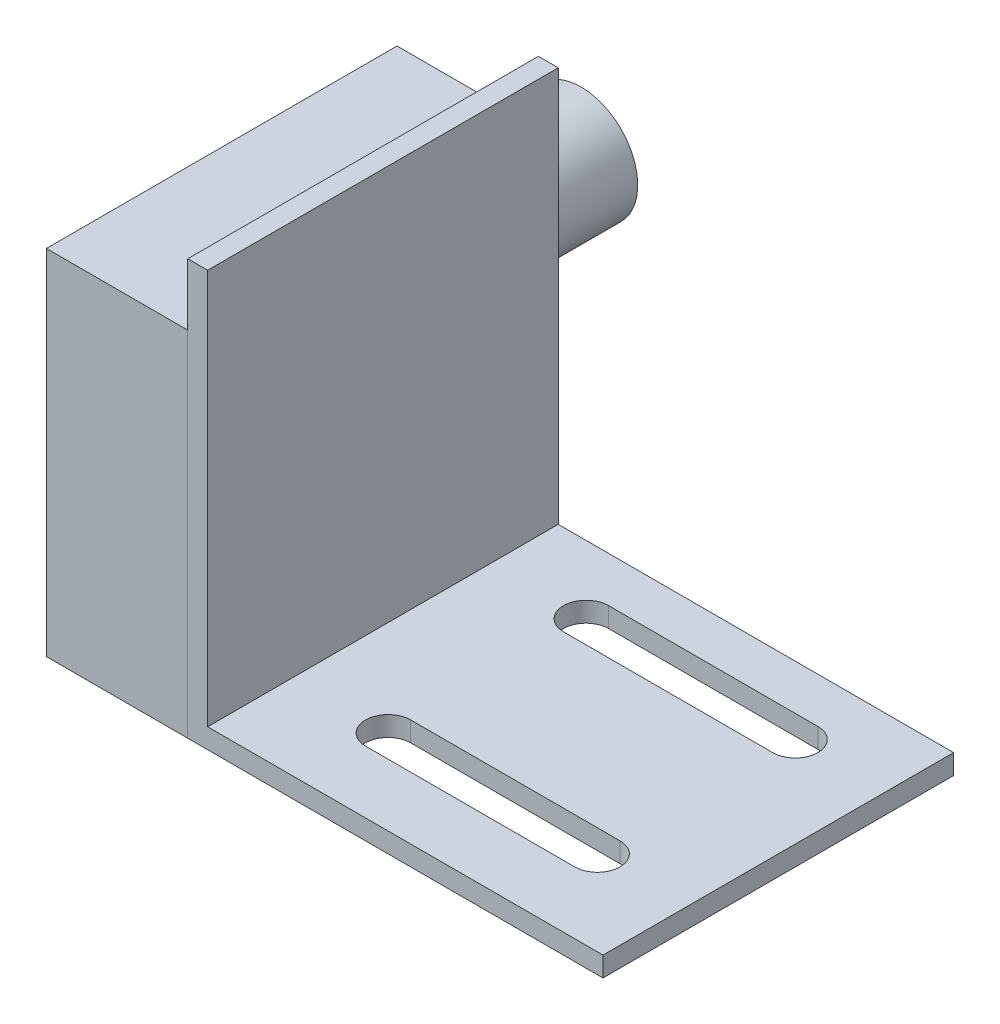
ISO-10303-21;
HEADER;
FILE_DESCRIPTION(('STEP AP214'),'2;1');
FILE_NAME('part.step','',(''),(''),'','','');
FILE_SCHEMA(('AUTOMOTIVE_DESIGN { 1 0 10303 214 1 1 1 1 }'));
ENDSEC;
DATA;
#1=APPLICATION_CONTEXT('core data for automotive mechanical design processes');
#2=APPLICATION_PROTOCOL_DEFINITION('international standard','automotive_design',2000,#1);
#3=PRODUCT_CONTEXT('',#1,'mechanical');
#4=PRODUCT('Part','Part','',(#3));
#5=PRODUCT_RELATED_PRODUCT_CATEGORY('part','',(#4));
#6=PRODUCT_DEFINITION_FORMATION('','',#4);
#7=PRODUCT_DEFINITION_CONTEXT('part definition',#1,'design');
#8=PRODUCT_DEFINITION('design','',#6,#7);
#9=PRODUCT_DEFINITION_SHAPE('','',#8);
#10=(LENGTH_UNIT() NAMED_UNIT(*) SI_UNIT(.MILLI.,.METRE.));
#11=(NAMED_UNIT(*) PLANE_ANGLE_UNIT() SI_UNIT($,.RADIAN.));
#12=(NAMED_UNIT(*) SI_UNIT($,.STERADIAN.) SOLID_ANGLE_UNIT());
#13=UNCERTAINTY_MEASURE_WITH_UNIT(LENGTH_MEASURE(1.E-05),#10,'distance_accuracy_value','');
#14=(GEOMETRIC_REPRESENTATION_CONTEXT(3) GLOBAL_UNCERTAINTY_ASSIGNED_CONTEXT((#13)) GLOBAL_UNIT_ASSIGNED_CONTEXT((#10,
#11,#12)) REPRESENTATION_CONTEXT('',''));
#15=CARTESIAN_POINT('',(0.,0.,0.));
#16=DIRECTION('',(0.,0.,1.));
#17=DIRECTION('',(1.,0.,0.));
#18=AXIS2_PLACEMENT_3D('',#15,#16,#17);
#19=CARTESIAN_POINT('',(-12.7,0.,15.748));
#20=DIRECTION('',(0.,0.,-1.));
#21=DIRECTION('',(-1.,0.,0.));
#22=AXIS2_PLACEMENT_3D('',#19,#20,#21);
#23=PLANE('',#22);
#24=DIRECTION('',(0.,1.,0.));
#25=VECTOR('',#24,1.);
#26=CARTESIAN_POINT('',(0.,0.,15.748));
#27=LINE('',#26,#25);
#28=CARTESIAN_POINT('',(0.,0.,15.748));
#29=VERTEX_POINT('',#28);
#30=CARTESIAN_POINT('',(0.,31.75,15.748));
#31=VERTEX_POINT('',#30);
#32=EDGE_CURVE('E109',#29,#31,#27,.T.);
#33=ORIENTED_EDGE('',*,*,#32,.T.);
#34=DIRECTION('',(1.,0.,0.));
#35=VECTOR('',#34,1.);
#36=CARTESIAN_POINT('',(-12.7,31.75,15.748));
#37=LINE('',#36,#35);
#38=CARTESIAN_POINT('',(-12.7,31.75,15.748));
#39=VERTEX_POINT('',#38);
#40=EDGE_CURVE('E46',#39,#31,#37,.T.);
#41=ORIENTED_EDGE('',*,*,#40,.F.);
#42=DIRECTION('',(0.,1.,0.));
#43=VECTOR('',#42,1.);
#44=CARTESIAN_POINT('',(-12.7,0.,15.748));
#45=LINE('',#44,#43);
#46=CARTESIAN_POINT('',(-12.7,0.,15.748));
#47=VERTEX_POINT('',#46);
#48=EDGE_CURVE('E96',#47,#39,#45,.T.);
#49=ORIENTED_EDGE('',*,*,#48,.F.);
#50=DIRECTION('',(1.,0.,0.));
#51=VECTOR('',#50,1.);
#52=CARTESIAN_POINT('',(-12.7,0.,15.748));
#53=LINE('',#52,#51);
#54=EDGE_CURVE('E105',#47,#29,#53,.T.);
#55=ORIENTED_EDGE('',*,*,#54,.T.);
#56=EDGE_LOOP('',(#33,#41,#49,#55));
#57=FACE_BOUND('',#56,.T.);
#58=ADVANCED_FACE('F43',(#57),#23,.F.);
#59=CARTESIAN_POINT('',(-12.7,31.75,15.748));
#60=DIRECTION('',(0.,-1.,0.));
#61=DIRECTION('',(0.,0.,-1.));
#62=AXIS2_PLACEMENT_3D('',#59,#60,#61);
#63=PLANE('',#62);
#64=DIRECTION('',(0.,0.,-1.));
#65=VECTOR('',#64,1.);
#66=CARTESIAN_POINT('',(0.,31.75,15.748));
#67=LINE('',#66,#65);
#68=CARTESIAN_POINT('',(0.,31.75,-15.748));
#69=VERTEX_POINT('',#68);
#70=EDGE_CURVE('E101',#31,#69,#67,.T.);
#71=ORIENTED_EDGE('',*,*,#70,.T.);
#72=DIRECTION('',(1.,0.,0.));
#73=VECTOR('',#72,1.);
#74=CARTESIAN_POINT('',(-12.7,31.75,-15.748));
#75=LINE('',#74,#73);
#76=CARTESIAN_POINT('',(-12.7,31.75,-15.748));
#77=VERTEX_POINT('',#76);
#78=EDGE_CURVE('E99',#77,#69,#75,.T.);
#79=ORIENTED_EDGE('',*,*,#78,.F.);
#80=DIRECTION('',(0.,0.,-1.));
#81=VECTOR('',#80,1.);
#82=CARTESIAN_POINT('',(-12.7,31.75,15.748));
#83=LINE('',#82,#81);
#84=EDGE_CURVE('E91',#39,#77,#83,.T.);
#85=ORIENTED_EDGE('',*,*,#84,.F.);
#86=ORIENTED_EDGE('',*,*,#40,.T.);
#87=EDGE_LOOP('',(#71,#79,#85,#86));
#88=FACE_BOUND('',#87,.T.);
#89=ADVANCED_FACE('F100',(#88),#63,.F.);
#90=CARTESIAN_POINT('',(-12.7,0.,-15.748));
#91=DIRECTION('',(0.,0.,1.));
#92=DIRECTION('',(1.,0.,0.));
#93=AXIS2_PLACEMENT_3D('',#90,#91,#92);
#94=PLANE('',#93);
#95=CARTESIAN_POINT('',(-6.32090999527844,21.59,-15.748));
#96=DIRECTION('',(0.,0.,-1.));
#97=DIRECTION('',(-1.,0.,0.));
#98=AXIS2_PLACEMENT_3D('',#95,#96,#97);
#99=CIRCLE('',#98,5.08);
#100=CARTESIAN_POINT('',(-11.4009099952784,21.59,-15.748));
#101=VERTEX_POINT('',#100);
#102=EDGE_CURVE('E12',#101,#101,#99,.T.);
#103=ORIENTED_EDGE('',*,*,#102,.F.);
#104=EDGE_LOOP('',(#103));
#105=FACE_BOUND('',#104,.T.);
#106=DIRECTION('',(0.,-1.,0.));
#107=VECTOR('',#106,1.);
#108=CARTESIAN_POINT('',(0.,0.,-15.748));
#109=LINE('',#108,#107);
#110=CARTESIAN_POINT('',(0.,0.,-15.748));
#111=VERTEX_POINT('',#110);
#112=EDGE_CURVE('E77',#69,#111,#109,.T.);
#113=ORIENTED_EDGE('',*,*,#112,.T.);
#114=DIRECTION('',(1.,0.,0.));
#115=VECTOR('',#114,1.);
#116=CARTESIAN_POINT('',(-12.7,0.,-15.748));
#117=LINE('',#116,#115);
#118=CARTESIAN_POINT('',(-12.7,0.,-15.748));
#119=VERTEX_POINT('',#118);
#120=EDGE_CURVE('E102',#119,#111,#117,.T.);
#121=ORIENTED_EDGE('',*,*,#120,.F.);
#122=DIRECTION('',(0.,-1.,0.));
#123=VECTOR('',#122,1.);
#124=CARTESIAN_POINT('',(-12.7,0.,-15.748));
#125=LINE('',#124,#123);
#126=EDGE_CURVE('E94',#77,#119,#125,.T.);
#127=ORIENTED_EDGE('',*,*,#126,.F.);
#128=ORIENTED_EDGE('',*,*,#78,.T.);
#129=EDGE_LOOP('',(#113,#121,#127,#128));
#130=FACE_BOUND('',#129,.T.);
#131=ADVANCED_FACE('F103',(#105,#130),#94,.F.);
#132=CARTESIAN_POINT('',(-12.7,0.,15.748));
#133=DIRECTION('',(0.,1.,0.));
#134=DIRECTION('',(0.,0.,1.));
#135=AXIS2_PLACEMENT_3D('',#132,#133,#134);
#136=PLANE('',#135);
#137=DIRECTION('',(0.,0.,1.));
#138=VECTOR('',#137,1.);
#139=CARTESIAN_POINT('',(0.,0.,15.748));
#140=LINE('',#139,#138);
#141=EDGE_CURVE('E83',#111,#29,#140,.T.);
#142=ORIENTED_EDGE('',*,*,#141,.T.);
#143=ORIENTED_EDGE('',*,*,#54,.F.);
#144=DIRECTION('',(0.,0.,1.));
#145=VECTOR('',#144,1.);
#146=CARTESIAN_POINT('',(-12.7,0.,15.748));
#147=LINE('',#146,#145);
#148=EDGE_CURVE('E60',#119,#47,#147,.T.);
#149=ORIENTED_EDGE('',*,*,#148,.F.);
#150=ORIENTED_EDGE('',*,*,#120,.T.);
#151=EDGE_LOOP('',(#142,#143,#149,#150));
#152=FACE_BOUND('',#151,.T.);
#153=ADVANCED_FACE('F117',(#152),#136,.F.);
#154=CARTESIAN_POINT('',(-12.7,0.,0.));
#155=DIRECTION('',(-1.,0.,0.));
#156=DIRECTION('',(0.,0.,1.));
#157=AXIS2_PLACEMENT_3D('',#154,#155,#156);
#158=PLANE('',#157);
#159=ORIENTED_EDGE('',*,*,#48,.T.);
#160=ORIENTED_EDGE('',*,*,#84,.T.);
#161=ORIENTED_EDGE('',*,*,#126,.T.);
#162=ORIENTED_EDGE('',*,*,#148,.T.);
#163=EDGE_LOOP('',(#159,#160,#161,#162));
#164=FACE_BOUND('',#163,.T.);
#165=ADVANCED_FACE('F92',(#164),#158,.T.);
#166=CARTESIAN_POINT('',(0.,0.,0.));
#167=DIRECTION('',(-1.,0.,0.));
#168=DIRECTION('',(0.,0.,1.));
#169=AXIS2_PLACEMENT_3D('',#166,#167,#168);
#170=PLANE('',#169);
#171=ORIENTED_EDGE('',*,*,#32,.F.);
#172=ORIENTED_EDGE('',*,*,#141,.F.);
#173=ORIENTED_EDGE('',*,*,#112,.F.);
#174=ORIENTED_EDGE('',*,*,#70,.F.);
#175=EDGE_LOOP('',(#171,#172,#173,#174));
#176=FACE_BOUND('',#175,.T.);
#177=ADVANCED_FACE('F120',(#176),#170,.F.);
#178=CARTESIAN_POINT('',(-6.32090999527844,21.59,-25.908));
#179=DIRECTION('',(0.,0.,1.));
#180=DIRECTION('',(1.,0.,0.));
#181=AXIS2_PLACEMENT_3D('',#178,#179,#180);
#182=CYLINDRICAL_SURFACE('',#181,5.08);
#183=CARTESIAN_POINT('',(-6.32090999527844,21.59,-25.908));
#184=DIRECTION('',(0.,0.,-1.));
#185=DIRECTION('',(-1.,0.,0.));
#186=AXIS2_PLACEMENT_3D('',#183,#184,#185);
#187=CIRCLE('',#186,5.08);
#188=CARTESIAN_POINT('',(-11.4009099952784,21.59,-25.908));
#189=VERTEX_POINT('',#188);
#190=EDGE_CURVE('E112',#189,#189,#187,.T.);
#191=ORIENTED_EDGE('',*,*,#190,.F.);
#192=EDGE_LOOP('',(#191));
#193=FACE_BOUND('',#192,.T.);
#194=ORIENTED_EDGE('',*,*,#102,.T.);
#195=EDGE_LOOP('',(#194));
#196=FACE_BOUND('',#195,.T.);
#197=ADVANCED_FACE('F128',(#193,#196),#182,.T.);
#198=CARTESIAN_POINT('',(-6.32090999527844,21.59,-25.908));
#199=DIRECTION('',(0.,0.,-1.));
#200=DIRECTION('',(-1.,0.,0.));
#201=AXIS2_PLACEMENT_3D('',#198,#199,#200);
#202=PLANE('',#201);
#203=ORIENTED_EDGE('',*,*,#190,.T.);
#204=EDGE_LOOP('',(#203));
#205=FACE_BOUND('',#204,.T.);
#206=ADVANCED_FACE('F126',(#205),#202,.T.);
#207=CLOSED_SHELL('',(#58,#89,#131,#153,#165,#177,#197,#206));
#208=MANIFOLD_SOLID_BREP('B2',#207);
#209=CARTESIAN_POINT('',(37.2983127050204,0.,15.748));
#210=DIRECTION('',(0.,1.,0.));
#211=DIRECTION('',(-1.,0.,0.));
#212=AXIS2_PLACEMENT_3D('',#209,#210,#211);
#213=PLANE('',#212);
#214=DIRECTION('',(1.,0.,0.));
#215=VECTOR('',#214,1.);
#216=CARTESIAN_POINT('',(29.1703127050204,0.,10.16));
#217=LINE('',#216,#215);
#218=CARTESIAN_POINT('',(10.3743127050204,0.,10.16));
#219=VERTEX_POINT('',#218);
#220=CARTESIAN_POINT('',(29.1703127050204,0.,10.16));
#221=VERTEX_POINT('',#220);
#222=EDGE_CURVE('E305',#219,#221,#217,.T.);
#223=ORIENTED_EDGE('',*,*,#222,.T.);
#224=CARTESIAN_POINT('',(29.1703127050204,0.,8.128));
#225=DIRECTION('',(0.,1.,0.));
#226=DIRECTION('',(0.,0.,1.));
#227=AXIS2_PLACEMENT_3D('',#224,#225,#226);
#228=CIRCLE('',#227,2.032);
#229=CARTESIAN_POINT('',(29.1703127050204,0.,6.096));
#230=VERTEX_POINT('',#229);
#231=EDGE_CURVE('E299',#221,#230,#228,.T.);
#232=ORIENTED_EDGE('',*,*,#231,.T.);
#233=DIRECTION('',(-1.,0.,0.));
#234=VECTOR('',#233,1.);
#235=CARTESIAN_POINT('',(29.1703127050204,0.,6.096));
#236=LINE('',#235,#234);
#237=CARTESIAN_POINT('',(10.3743127050204,0.,6.096));
#238=VERTEX_POINT('',#237);
#239=EDGE_CURVE('E308',#230,#238,#236,.T.);
#240=ORIENTED_EDGE('',*,*,#239,.T.);
#241=CARTESIAN_POINT('',(10.3743127050204,0.,8.128));
#242=DIRECTION('',(0.,1.,0.));
#243=DIRECTION('',(0.,0.,1.));
#244=AXIS2_PLACEMENT_3D('',#241,#242,#243);
#245=CIRCLE('',#244,2.032);
#246=EDGE_CURVE('E211',#238,#219,#245,.T.);
#247=ORIENTED_EDGE('',*,*,#246,.T.);
#248=EDGE_LOOP('',(#223,#232,#240,#247));
#249=FACE_BOUND('',#248,.T.);
#250=DIRECTION('',(1.,0.,0.));
#251=VECTOR('',#250,1.);
#252=CARTESIAN_POINT('',(29.1703127050204,0.,-7.62));
#253=LINE('',#252,#251);
#254=CARTESIAN_POINT('',(10.3743127050204,0.,-7.61999999999999));
#255=VERTEX_POINT('',#254);
#256=CARTESIAN_POINT('',(29.1703127050204,0.,-7.62));
#257=VERTEX_POINT('',#256);
#258=EDGE_CURVE('E343',#255,#257,#253,.T.);
#259=ORIENTED_EDGE('',*,*,#258,.T.);
#260=CARTESIAN_POINT('',(29.1703127050204,0.,-9.652));
#261=DIRECTION('',(0.,1.,0.));
#262=DIRECTION('',(0.,0.,1.));
#263=AXIS2_PLACEMENT_3D('',#260,#261,#262);
#264=CIRCLE('',#263,2.032);
#265=CARTESIAN_POINT('',(29.1703127050204,0.,-11.684));
#266=VERTEX_POINT('',#265);
#267=EDGE_CURVE('E333',#257,#266,#264,.T.);
#268=ORIENTED_EDGE('',*,*,#267,.T.);
#269=DIRECTION('',(-1.,0.,0.));
#270=VECTOR('',#269,1.);
#271=CARTESIAN_POINT('',(29.1703127050204,0.,-11.684));
#272=LINE('',#271,#270);
#273=CARTESIAN_POINT('',(10.3743127050204,0.,-11.684));
#274=VERTEX_POINT('',#273);
#275=EDGE_CURVE('E336',#266,#274,#272,.T.);
#276=ORIENTED_EDGE('',*,*,#275,.T.);
#277=CARTESIAN_POINT('',(10.3743127050204,0.,-9.652));
#278=DIRECTION('',(0.,1.,0.));
#279=DIRECTION('',(0.,0.,1.));
#280=AXIS2_PLACEMENT_3D('',#277,#278,#279);
#281=CIRCLE('',#280,2.032);
#282=EDGE_CURVE('E340',#274,#255,#281,.T.);
#283=ORIENTED_EDGE('',*,*,#282,.T.);
#284=EDGE_LOOP('',(#259,#268,#276,#283));
#285=FACE_BOUND('',#284,.T.);
#286=DIRECTION('',(1.,0.,0.));
#287=VECTOR('',#286,1.);
#288=CARTESIAN_POINT('',(37.2983127050204,0.,-15.748));
#289=LINE('',#288,#287);
#290=CARTESIAN_POINT('',(0.,0.,-15.748));
#291=VERTEX_POINT('',#290);
#292=CARTESIAN_POINT('',(37.2983127050204,0.,-15.748));
#293=VERTEX_POINT('',#292);
#294=EDGE_CURVE('E358',#291,#293,#289,.T.);
#295=ORIENTED_EDGE('',*,*,#294,.T.);
#296=DIRECTION('',(0.,0.,-1.));
#297=VECTOR('',#296,1.);
#298=CARTESIAN_POINT('',(37.2983127050204,0.,15.748));
#299=LINE('',#298,#297);
#300=CARTESIAN_POINT('',(37.2983127050204,0.,15.748));
#301=VERTEX_POINT('',#300);
#302=EDGE_CURVE('E41',#301,#293,#299,.T.);
#303=ORIENTED_EDGE('',*,*,#302,.F.);
#304=DIRECTION('',(1.,0.,0.));
#305=VECTOR('',#304,1.);
#306=CARTESIAN_POINT('',(37.2983127050204,0.,15.748));
#307=LINE('',#306,#305);
#308=CARTESIAN_POINT('',(0.,0.,15.748));
#309=VERTEX_POINT('',#308);
#310=EDGE_CURVE('E365',#309,#301,#307,.T.);
#311=ORIENTED_EDGE('',*,*,#310,.F.);
#312=DIRECTION('',(0.,0.,-1.));
#313=VECTOR('',#312,1.);
#314=CARTESIAN_POINT('',(0.,0.,15.748));
#315=LINE('',#314,#313);
#316=EDGE_CURVE('E379',#309,#291,#315,.T.);
#317=ORIENTED_EDGE('',*,*,#316,.T.);
#318=EDGE_LOOP('',(#295,#303,#311,#317));
#319=FACE_BOUND('',#318,.T.);
#320=ADVANCED_FACE('F197',(#249,#285,#319),#213,.F.);
#321=CARTESIAN_POINT('',(37.2983127050204,1.78490776787044,15.748));
#322=DIRECTION('',(-1.,0.,0.));
#323=DIRECTION('',(0.,0.,1.));
#324=AXIS2_PLACEMENT_3D('',#321,#322,#323);
#325=PLANE('',#324);
#326=DIRECTION('',(0.,1.,0.));
#327=VECTOR('',#326,1.);
#328=CARTESIAN_POINT('',(37.2983127050204,1.78490776787044,-15.748));
#329=LINE('',#328,#327);
#330=CARTESIAN_POINT('',(37.2983127050204,1.78490776787044,-15.748));
#331=VERTEX_POINT('',#330);
#332=EDGE_CURVE('E382',#293,#331,#329,.T.);
#333=ORIENTED_EDGE('',*,*,#332,.T.);
#334=DIRECTION('',(0.,0.,-1.));
#335=VECTOR('',#334,1.);
#336=CARTESIAN_POINT('',(37.2983127050204,1.78490776787044,15.748));
#337=LINE('',#336,#335);
#338=CARTESIAN_POINT('',(37.2983127050204,1.78490776787044,15.748));
#339=VERTEX_POINT('',#338);
#340=EDGE_CURVE('E204',#339,#331,#337,.T.);
#341=ORIENTED_EDGE('',*,*,#340,.F.);
#342=DIRECTION('',(0.,1.,0.));
#343=VECTOR('',#342,1.);
#344=CARTESIAN_POINT('',(37.2983127050204,1.78490776787044,15.748));
#345=LINE('',#344,#343);
#346=EDGE_CURVE('E368',#301,#339,#345,.T.);
#347=ORIENTED_EDGE('',*,*,#346,.F.);
#348=ORIENTED_EDGE('',*,*,#302,.T.);
#349=EDGE_LOOP('',(#333,#341,#347,#348));
#350=FACE_BOUND('',#349,.T.);
#351=ADVANCED_FACE('F429',(#350),#325,.F.);
#352=CARTESIAN_POINT('',(1.78490776787044,1.78490776787044,15.748));
#353=DIRECTION('',(0.,-1.,0.));
#354=DIRECTION('',(0.,0.,-1.));
#355=AXIS2_PLACEMENT_3D('',#352,#353,#354);
#356=PLANE('',#355);
#357=DIRECTION('',(-1.,0.,0.));
#358=VECTOR('',#357,1.);
#359=CARTESIAN_POINT('',(29.1703127050204,1.78490776787044,6.096));
#360=LINE('',#359,#358);
#361=CARTESIAN_POINT('',(29.1703127050204,1.78490776787044,6.096));
#362=VERTEX_POINT('',#361);
#363=CARTESIAN_POINT('',(10.3743127050204,1.78490776787044,6.096));
#364=VERTEX_POINT('',#363);
#365=EDGE_CURVE('E323',#362,#364,#360,.T.);
#366=ORIENTED_EDGE('',*,*,#365,.F.);
#367=CARTESIAN_POINT('',(29.1703127050204,1.78490776787044,8.128));
#368=DIRECTION('',(0.,1.,0.));
#369=DIRECTION('',(0.,0.,1.));
#370=AXIS2_PLACEMENT_3D('',#367,#368,#369);
#371=CIRCLE('',#370,2.032);
#372=CARTESIAN_POINT('',(29.1703127050204,1.78490776787044,10.16));
#373=VERTEX_POINT('',#372);
#374=EDGE_CURVE('E219',#373,#362,#371,.T.);
#375=ORIENTED_EDGE('',*,*,#374,.F.);
#376=DIRECTION('',(1.,0.,0.));
#377=VECTOR('',#376,1.);
#378=CARTESIAN_POINT('',(29.1703127050204,1.78490776787044,10.16));
#379=LINE('',#378,#377);
#380=CARTESIAN_POINT('',(10.3743127050204,1.78490776787044,10.16));
#381=VERTEX_POINT('',#380);
#382=EDGE_CURVE('E314',#381,#373,#379,.T.);
#383=ORIENTED_EDGE('',*,*,#382,.F.);
#384=CARTESIAN_POINT('',(10.3743127050204,1.78490776787044,8.128));
#385=DIRECTION('',(0.,1.,0.));
#386=DIRECTION('',(0.,0.,1.));
#387=AXIS2_PLACEMENT_3D('',#384,#385,#386);
#388=CIRCLE('',#387,2.032);
#389=EDGE_CURVE('E317',#364,#381,#388,.T.);
#390=ORIENTED_EDGE('',*,*,#389,.F.);
#391=EDGE_LOOP('',(#366,#375,#383,#390));
#392=FACE_BOUND('',#391,.T.);
#393=DIRECTION('',(-1.,0.,0.));
#394=VECTOR('',#393,1.);
#395=CARTESIAN_POINT('',(29.1703127050204,1.78490776787044,-11.684));
#396=LINE('',#395,#394);
#397=CARTESIAN_POINT('',(29.1703127050204,1.78490776787044,-11.684));
#398=VERTEX_POINT('',#397);
#399=CARTESIAN_POINT('',(10.3743127050204,1.78490776787044,-11.684));
#400=VERTEX_POINT('',#399);
#401=EDGE_CURVE('E348',#398,#400,#396,.T.);
#402=ORIENTED_EDGE('',*,*,#401,.F.);
#403=CARTESIAN_POINT('',(29.1703127050204,1.78490776787044,-9.652));
#404=DIRECTION('',(0.,1.,0.));
#405=DIRECTION('',(0.,0.,1.));
#406=AXIS2_PLACEMENT_3D('',#403,#404,#405);
#407=CIRCLE('',#406,2.032);
#408=CARTESIAN_POINT('',(29.1703127050204,1.78490776787044,-7.62));
#409=VERTEX_POINT('',#408);
#410=EDGE_CURVE('E329',#409,#398,#407,.T.);
#411=ORIENTED_EDGE('',*,*,#410,.F.);
#412=DIRECTION('',(1.,0.,0.));
#413=VECTOR('',#412,1.);
#414=CARTESIAN_POINT('',(29.1703127050204,1.78490776787044,-7.62));
#415=LINE('',#414,#413);
#416=CARTESIAN_POINT('',(10.3743127050204,1.78490776787044,-7.61999999999999));
#417=VERTEX_POINT('',#416);
#418=EDGE_CURVE('E337',#417,#409,#415,.T.);
#419=ORIENTED_EDGE('',*,*,#418,.F.);
#420=CARTESIAN_POINT('',(10.3743127050204,1.78490776787044,-9.652));
#421=DIRECTION('',(0.,1.,0.));
#422=DIRECTION('',(0.,0.,1.));
#423=AXIS2_PLACEMENT_3D('',#420,#421,#422);
#424=CIRCLE('',#423,2.032);
#425=EDGE_CURVE('E351',#400,#417,#424,.T.);
#426=ORIENTED_EDGE('',*,*,#425,.F.);
#427=EDGE_LOOP('',(#402,#411,#419,#426));
#428=FACE_BOUND('',#427,.T.);
#429=DIRECTION('',(-1.,0.,0.));
#430=VECTOR('',#429,1.);
#431=CARTESIAN_POINT('',(1.78490776787044,1.78490776787044,-15.748));
#432=LINE('',#431,#430);
#433=CARTESIAN_POINT('',(1.78490776787044,1.78490776787044,-15.748));
#434=VERTEX_POINT('',#433);
#435=EDGE_CURVE('E384',#331,#434,#432,.T.);
#436=ORIENTED_EDGE('',*,*,#435,.T.);
#437=DIRECTION('',(0.,0.,-1.));
#438=VECTOR('',#437,1.);
#439=CARTESIAN_POINT('',(1.78490776787044,1.78490776787044,15.748));
#440=LINE('',#439,#438);
#441=CARTESIAN_POINT('',(1.78490776787044,1.78490776787044,15.748));
#442=VERTEX_POINT('',#441);
#443=EDGE_CURVE('E399',#442,#434,#440,.T.);
#444=ORIENTED_EDGE('',*,*,#443,.F.);
#445=DIRECTION('',(-1.,0.,0.));
#446=VECTOR('',#445,1.);
#447=CARTESIAN_POINT('',(1.78490776787044,1.78490776787044,15.748));
#448=LINE('',#447,#446);
#449=EDGE_CURVE('E371',#339,#442,#448,.T.);
#450=ORIENTED_EDGE('',*,*,#449,.F.);
#451=ORIENTED_EDGE('',*,*,#340,.T.);
#452=EDGE_LOOP('',(#436,#444,#450,#451));
#453=FACE_BOUND('',#452,.T.);
#454=ADVANCED_FACE('F406',(#392,#428,#453),#356,.F.);
#455=CARTESIAN_POINT('',(1.78490776787044,37.2983127050204,15.748));
#456=DIRECTION('',(-1.,0.,0.));
#457=DIRECTION('',(0.,-1.,0.));
#458=AXIS2_PLACEMENT_3D('',#455,#456,#457);
#459=PLANE('',#458);
#460=DIRECTION('',(0.,1.,0.));
#461=VECTOR('',#460,1.);
#462=CARTESIAN_POINT('',(1.78490776787044,37.2983127050204,-15.748));
#463=LINE('',#462,#461);
#464=CARTESIAN_POINT('',(1.78490776787044,37.2983127050204,-15.748));
#465=VERTEX_POINT('',#464);
#466=EDGE_CURVE('E386',#434,#465,#463,.T.);
#467=ORIENTED_EDGE('',*,*,#466,.T.);
#468=DIRECTION('',(0.,0.,-1.));
#469=VECTOR('',#468,1.);
#470=CARTESIAN_POINT('',(1.78490776787044,37.2983127050204,15.748));
#471=LINE('',#470,#469);
#472=CARTESIAN_POINT('',(1.78490776787044,37.2983127050204,15.748));
#473=VERTEX_POINT('',#472);
#474=EDGE_CURVE('E396',#473,#465,#471,.T.);
#475=ORIENTED_EDGE('',*,*,#474,.F.);
#476=DIRECTION('',(0.,1.,0.));
#477=VECTOR('',#476,1.);
#478=CARTESIAN_POINT('',(1.78490776787044,37.2983127050204,15.748));
#479=LINE('',#478,#477);
#480=EDGE_CURVE('E373',#442,#473,#479,.T.);
#481=ORIENTED_EDGE('',*,*,#480,.F.);
#482=ORIENTED_EDGE('',*,*,#443,.T.);
#483=EDGE_LOOP('',(#467,#475,#481,#482));
#484=FACE_BOUND('',#483,.T.);
#485=ADVANCED_FACE('F417',(#484),#459,.F.);
#486=CARTESIAN_POINT('',(0.,37.2983127050204,15.748));
#487=DIRECTION('',(0.,-1.,0.));
#488=DIRECTION('',(0.,0.,-1.));
#489=AXIS2_PLACEMENT_3D('',#486,#487,#488);
#490=PLANE('',#489);
#491=DIRECTION('',(-1.,0.,0.));
#492=VECTOR('',#491,1.);
#493=CARTESIAN_POINT('',(0.,37.2983127050204,-15.748));
#494=LINE('',#493,#492);
#495=CARTESIAN_POINT('',(0.,37.2983127050204,-15.748));
#496=VERTEX_POINT('',#495);
#497=EDGE_CURVE('E388',#465,#496,#494,.T.);
#498=ORIENTED_EDGE('',*,*,#497,.T.);
#499=DIRECTION('',(0.,0.,-1.));
#500=VECTOR('',#499,1.);
#501=CARTESIAN_POINT('',(0.,37.2983127050204,15.748));
#502=LINE('',#501,#500);
#503=CARTESIAN_POINT('',(0.,37.2983127050204,15.748));
#504=VERTEX_POINT('',#503);
#505=EDGE_CURVE('E393',#504,#496,#502,.T.);
#506=ORIENTED_EDGE('',*,*,#505,.F.);
#507=DIRECTION('',(-1.,0.,0.));
#508=VECTOR('',#507,1.);
#509=CARTESIAN_POINT('',(0.,37.2983127050204,15.748));
#510=LINE('',#509,#508);
#511=EDGE_CURVE('E375',#473,#504,#510,.T.);
#512=ORIENTED_EDGE('',*,*,#511,.F.);
#513=ORIENTED_EDGE('',*,*,#474,.T.);
#514=EDGE_LOOP('',(#498,#506,#512,#513));
#515=FACE_BOUND('',#514,.T.);
#516=ADVANCED_FACE('F421',(#515),#490,.F.);
#517=CARTESIAN_POINT('',(0.,0.,15.748));
#518=DIRECTION('',(1.,0.,0.));
#519=DIRECTION('',(0.,0.,-1.));
#520=AXIS2_PLACEMENT_3D('',#517,#518,#519);
#521=PLANE('',#520);
#522=DIRECTION('',(0.,-1.,0.));
#523=VECTOR('',#522,1.);
#524=CARTESIAN_POINT('',(0.,0.,-15.748));
#525=LINE('',#524,#523);
#526=EDGE_CURVE('E369',#496,#291,#525,.T.);
#527=ORIENTED_EDGE('',*,*,#526,.T.);
#528=ORIENTED_EDGE('',*,*,#316,.F.);
#529=DIRECTION('',(0.,-1.,0.));
#530=VECTOR('',#529,1.);
#531=CARTESIAN_POINT('',(0.,0.,15.748));
#532=LINE('',#531,#530);
#533=EDGE_CURVE('E377',#504,#309,#532,.T.);
#534=ORIENTED_EDGE('',*,*,#533,.F.);
#535=ORIENTED_EDGE('',*,*,#505,.T.);
#536=EDGE_LOOP('',(#527,#528,#534,#535));
#537=FACE_BOUND('',#536,.T.);
#538=ADVANCED_FACE('F432',(#537),#521,.F.);
#539=CARTESIAN_POINT('',(0.,0.,15.748));
#540=DIRECTION('',(0.,0.,-1.));
#541=DIRECTION('',(-1.,0.,0.));
#542=AXIS2_PLACEMENT_3D('',#539,#540,#541);
#543=PLANE('',#542);
#544=ORIENTED_EDGE('',*,*,#310,.T.);
#545=ORIENTED_EDGE('',*,*,#346,.T.);
#546=ORIENTED_EDGE('',*,*,#449,.T.);
#547=ORIENTED_EDGE('',*,*,#480,.T.);
#548=ORIENTED_EDGE('',*,*,#511,.T.);
#549=ORIENTED_EDGE('',*,*,#533,.T.);
#550=EDGE_LOOP('',(#544,#545,#546,#547,#548,#549));
#551=FACE_BOUND('',#550,.T.);
#552=ADVANCED_FACE('F425',(#551),#543,.F.);
#553=CARTESIAN_POINT('',(0.,0.,-15.748));
#554=DIRECTION('',(0.,0.,-1.));
#555=DIRECTION('',(-1.,0.,0.));
#556=AXIS2_PLACEMENT_3D('',#553,#554,#555);
#557=PLANE('',#556);
#558=ORIENTED_EDGE('',*,*,#294,.F.);
#559=ORIENTED_EDGE('',*,*,#526,.F.);
#560=ORIENTED_EDGE('',*,*,#497,.F.);
#561=ORIENTED_EDGE('',*,*,#466,.F.);
#562=ORIENTED_EDGE('',*,*,#435,.F.);
#563=ORIENTED_EDGE('',*,*,#332,.F.);
#564=EDGE_LOOP('',(#558,#559,#560,#561,#562,#563));
#565=FACE_BOUND('',#564,.T.);
#566=ADVANCED_FACE('F412',(#565),#557,.T.);
#567=CARTESIAN_POINT('',(29.1703127050204,0.,-9.652));
#568=DIRECTION('',(0.,1.,0.));
#569=DIRECTION('',(0.,0.,1.));
#570=AXIS2_PLACEMENT_3D('',#567,#568,#569);
#571=CYLINDRICAL_SURFACE('',#570,2.032);
#572=ORIENTED_EDGE('',*,*,#410,.T.);
#573=DIRECTION('',(0.,1.,0.));
#574=VECTOR('',#573,1.);
#575=CARTESIAN_POINT('',(29.1703127050204,0.,-11.684));
#576=LINE('',#575,#574);
#577=EDGE_CURVE('E346',#266,#398,#576,.T.);
#578=ORIENTED_EDGE('',*,*,#577,.F.);
#579=ORIENTED_EDGE('',*,*,#267,.F.);
#580=DIRECTION('',(0.,1.,0.));
#581=VECTOR('',#580,1.);
#582=CARTESIAN_POINT('',(29.1703127050204,0.,-7.62));
#583=LINE('',#582,#581);
#584=EDGE_CURVE('E356',#257,#409,#583,.T.);
#585=ORIENTED_EDGE('',*,*,#584,.T.);
#586=EDGE_LOOP('',(#572,#578,#579,#585));
#587=FACE_BOUND('',#586,.T.);
#588=ADVANCED_FACE('F480',(#587),#571,.F.);
#589=CARTESIAN_POINT('',(29.1703127050204,0.,-7.62));
#590=DIRECTION('',(0.,0.,1.));
#591=DIRECTION('',(1.,0.,0.));
#592=AXIS2_PLACEMENT_3D('',#589,#590,#591);
#593=PLANE('',#592);
#594=ORIENTED_EDGE('',*,*,#418,.T.);
#595=ORIENTED_EDGE('',*,*,#584,.F.);
#596=ORIENTED_EDGE('',*,*,#258,.F.);
#597=DIRECTION('',(0.,1.,0.));
#598=VECTOR('',#597,1.);
#599=CARTESIAN_POINT('',(10.3743127050204,0.,-7.61999999999999));
#600=LINE('',#599,#598);
#601=EDGE_CURVE('E359',#255,#417,#600,.T.);
#602=ORIENTED_EDGE('',*,*,#601,.T.);
#603=EDGE_LOOP('',(#594,#595,#596,#602));
#604=FACE_BOUND('',#603,.T.);
#605=ADVANCED_FACE('F488',(#604),#593,.F.);
#606=CARTESIAN_POINT('',(10.3743127050204,0.,-9.652));
#607=DIRECTION('',(0.,1.,0.));
#608=DIRECTION('',(0.,0.,1.));
#609=AXIS2_PLACEMENT_3D('',#606,#607,#608);
#610=CYLINDRICAL_SURFACE('',#609,2.032);
#611=ORIENTED_EDGE('',*,*,#425,.T.);
#612=ORIENTED_EDGE('',*,*,#601,.F.);
#613=ORIENTED_EDGE('',*,*,#282,.F.);
#614=DIRECTION('',(0.,1.,0.));
#615=VECTOR('',#614,1.);
#616=CARTESIAN_POINT('',(10.3743127050204,0.,-11.684));
#617=LINE('',#616,#615);
#618=EDGE_CURVE('E361',#274,#400,#617,.T.);
#619=ORIENTED_EDGE('',*,*,#618,.T.);
#620=EDGE_LOOP('',(#611,#612,#613,#619));
#621=FACE_BOUND('',#620,.T.);
#622=ADVANCED_FACE('F498',(#621),#610,.F.);
#623=CARTESIAN_POINT('',(29.1703127050204,0.,-11.684));
#624=DIRECTION('',(0.,0.,-1.));
#625=DIRECTION('',(-1.,0.,0.));
#626=AXIS2_PLACEMENT_3D('',#623,#624,#625);
#627=PLANE('',#626);
#628=ORIENTED_EDGE('',*,*,#401,.T.);
#629=ORIENTED_EDGE('',*,*,#618,.F.);
#630=ORIENTED_EDGE('',*,*,#275,.F.);
#631=ORIENTED_EDGE('',*,*,#577,.T.);
#632=EDGE_LOOP('',(#628,#629,#630,#631));
#633=FACE_BOUND('',#632,.T.);
#634=ADVANCED_FACE('F508',(#633),#627,.F.);
#635=CARTESIAN_POINT('',(29.1703127050204,0.,8.128));
#636=DIRECTION('',(0.,1.,0.));
#637=DIRECTION('',(0.,0.,1.));
#638=AXIS2_PLACEMENT_3D('',#635,#636,#637);
#639=CYLINDRICAL_SURFACE('',#638,2.032);
#640=ORIENTED_EDGE('',*,*,#374,.T.);
#641=DIRECTION('',(0.,1.,0.));
#642=VECTOR('',#641,1.);
#643=CARTESIAN_POINT('',(29.1703127050204,0.,6.096));
#644=LINE('',#643,#642);
#645=EDGE_CURVE('E295',#230,#362,#644,.T.);
#646=ORIENTED_EDGE('',*,*,#645,.F.);
#647=ORIENTED_EDGE('',*,*,#231,.F.);
#648=DIRECTION('',(0.,1.,0.));
#649=VECTOR('',#648,1.);
#650=CARTESIAN_POINT('',(29.1703127050204,0.,10.16));
#651=LINE('',#650,#649);
#652=EDGE_CURVE('E327',#221,#373,#651,.T.);
#653=ORIENTED_EDGE('',*,*,#652,.T.);
#654=EDGE_LOOP('',(#640,#646,#647,#653));
#655=FACE_BOUND('',#654,.T.);
#656=ADVANCED_FACE('F297',(#655),#639,.F.);
#657=CARTESIAN_POINT('',(29.1703127050204,0.,10.16));
#658=DIRECTION('',(0.,0.,1.));
#659=DIRECTION('',(1.,0.,0.));
#660=AXIS2_PLACEMENT_3D('',#657,#658,#659);
#661=PLANE('',#660);
#662=ORIENTED_EDGE('',*,*,#382,.T.);
#663=ORIENTED_EDGE('',*,*,#652,.F.);
#664=ORIENTED_EDGE('',*,*,#222,.F.);
#665=DIRECTION('',(0.,1.,0.));
#666=VECTOR('',#665,1.);
#667=CARTESIAN_POINT('',(10.3743127050204,0.,10.16));
#668=LINE('',#667,#666);
#669=EDGE_CURVE('E330',#219,#381,#668,.T.);
#670=ORIENTED_EDGE('',*,*,#669,.T.);
#671=EDGE_LOOP('',(#662,#663,#664,#670));
#672=FACE_BOUND('',#671,.T.);
#673=ADVANCED_FACE('F536',(#672),#661,.F.);
#674=CARTESIAN_POINT('',(10.3743127050204,0.,8.128));
#675=DIRECTION('',(0.,1.,0.));
#676=DIRECTION('',(0.,0.,1.));
#677=AXIS2_PLACEMENT_3D('',#674,#675,#676);
#678=CYLINDRICAL_SURFACE('',#677,2.032);
#679=ORIENTED_EDGE('',*,*,#389,.T.);
#680=ORIENTED_EDGE('',*,*,#669,.F.);
#681=ORIENTED_EDGE('',*,*,#246,.F.);
#682=DIRECTION('',(0.,1.,0.));
#683=VECTOR('',#682,1.);
#684=CARTESIAN_POINT('',(10.3743127050204,0.,6.096));
#685=LINE('',#684,#683);
#686=EDGE_CURVE('E304',#238,#364,#685,.T.);
#687=ORIENTED_EDGE('',*,*,#686,.T.);
#688=EDGE_LOOP('',(#679,#680,#681,#687));
#689=FACE_BOUND('',#688,.T.);
#690=ADVANCED_FACE('F545',(#689),#678,.F.);
#691=CARTESIAN_POINT('',(29.1703127050204,0.,6.096));
#692=DIRECTION('',(0.,0.,-1.));
#693=DIRECTION('',(-1.,0.,0.));
#694=AXIS2_PLACEMENT_3D('',#691,#692,#693);
#695=PLANE('',#694);
#696=ORIENTED_EDGE('',*,*,#365,.T.);
#697=ORIENTED_EDGE('',*,*,#686,.F.);
#698=ORIENTED_EDGE('',*,*,#239,.F.);
#699=ORIENTED_EDGE('',*,*,#645,.T.);
#700=EDGE_LOOP('',(#696,#697,#698,#699));
#701=FACE_BOUND('',#700,.T.);
#702=ADVANCED_FACE('F309',(#701),#695,.F.);
#703=CLOSED_SHELL('',(#320,#351,#454,#485,#516,#538,#552,#566,#588,#605,#622,#634,#656,#673,
#690,#702));
#704=MANIFOLD_SOLID_BREP('B6',#703);
#705=ADVANCED_BREP_SHAPE_REPRESENTATION('',(#18,#208,#704),#14);
#706=SHAPE_DEFINITION_REPRESENTATION(#9,#705);
ENDSEC;
END-ISO-10303-21;
